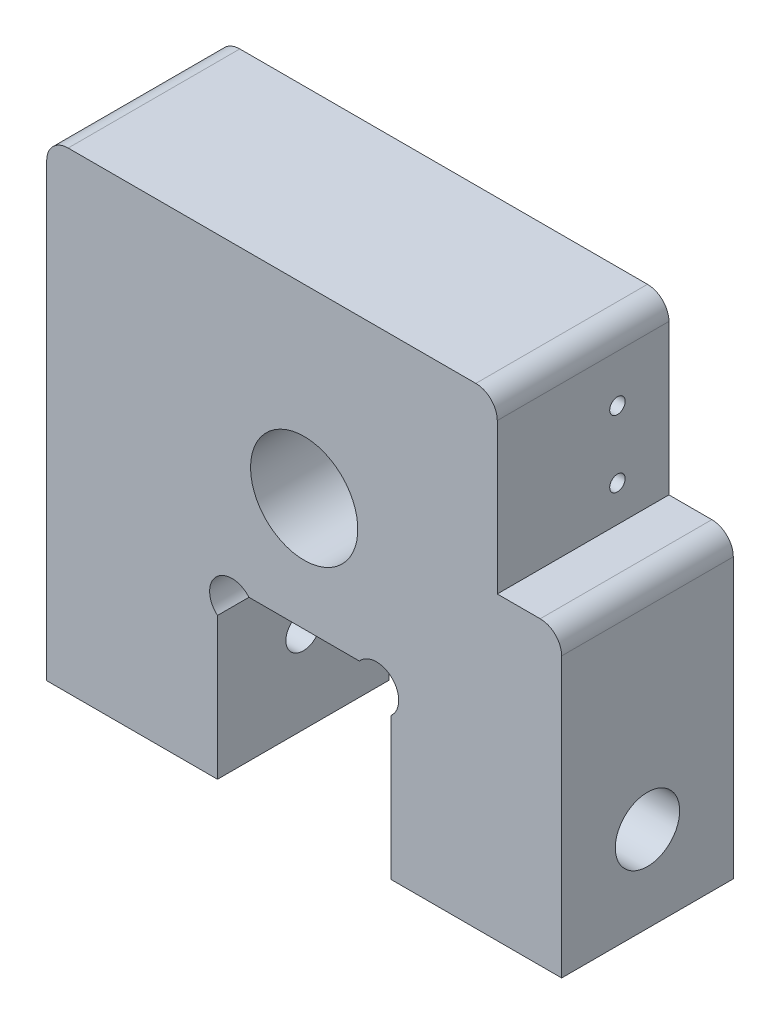
ISO-10303-21;
HEADER;
FILE_DESCRIPTION(('STEP AP214'),'2;1');
FILE_NAME('part.step','',(''),(''),'','','');
FILE_SCHEMA(('AUTOMOTIVE_DESIGN { 1 0 10303 214 1 1 1 1 }'));
ENDSEC;
DATA;
#1=APPLICATION_CONTEXT('core data for automotive mechanical design processes');
#2=APPLICATION_PROTOCOL_DEFINITION('international standard','automotive_design',2000,#1);
#3=PRODUCT_CONTEXT('',#1,'mechanical');
#4=PRODUCT('Part','Part','',(#3));
#5=PRODUCT_RELATED_PRODUCT_CATEGORY('part','',(#4));
#6=PRODUCT_DEFINITION_FORMATION('','',#4);
#7=PRODUCT_DEFINITION_CONTEXT('part definition',#1,'design');
#8=PRODUCT_DEFINITION('design','',#6,#7);
#9=PRODUCT_DEFINITION_SHAPE('','',#8);
#10=(LENGTH_UNIT() NAMED_UNIT(*) SI_UNIT(.MILLI.,.METRE.));
#11=(NAMED_UNIT(*) PLANE_ANGLE_UNIT() SI_UNIT($,.RADIAN.));
#12=(NAMED_UNIT(*) SI_UNIT($,.STERADIAN.) SOLID_ANGLE_UNIT());
#13=UNCERTAINTY_MEASURE_WITH_UNIT(LENGTH_MEASURE(1.E-05),#10,'distance_accuracy_value','');
#14=(GEOMETRIC_REPRESENTATION_CONTEXT(3) GLOBAL_UNCERTAINTY_ASSIGNED_CONTEXT((#13)) GLOBAL_UNIT_ASSIGNED_CONTEXT((#10,
#11,#12)) REPRESENTATION_CONTEXT('',''));
#15=CARTESIAN_POINT('',(0.,0.,0.));
#16=DIRECTION('',(0.,0.,1.));
#17=DIRECTION('',(1.,0.,0.));
#18=AXIS2_PLACEMENT_3D('',#15,#16,#17);
#19=CARTESIAN_POINT('',(-38.1,-22.225,12.7));
#20=DIRECTION('',(1.,0.,0.));
#21=DIRECTION('',(0.,0.,-1.));
#22=AXIS2_PLACEMENT_3D('',#19,#20,#21);
#23=CYLINDRICAL_SURFACE('',#22,2.5796875);
#24=CARTESIAN_POINT('',(-12.827,-22.225,12.7));
#25=DIRECTION('',(-1.,0.,0.));
#26=DIRECTION('',(0.,0.,1.));
#27=AXIS2_PLACEMENT_3D('',#24,#25,#26);
#28=CIRCLE('',#27,2.5796875);
#29=CARTESIAN_POINT('',(-12.827,-22.225,15.2796875));
#30=VERTEX_POINT('',#29);
#31=EDGE_CURVE('E248',#30,#30,#28,.T.);
#32=ORIENTED_EDGE('',*,*,#31,.F.);
#33=EDGE_LOOP('',(#32));
#34=FACE_BOUND('',#33,.T.);
#35=CARTESIAN_POINT('',(-27.7114,-22.225,12.7));
#36=DIRECTION('',(-1.,0.,0.));
#37=DIRECTION('',(0.,0.,1.));
#38=AXIS2_PLACEMENT_3D('',#35,#36,#37);
#39=CIRCLE('',#38,2.5796875);
#40=CARTESIAN_POINT('',(-27.7114,-22.225,15.2796875));
#41=VERTEX_POINT('',#40);
#42=EDGE_CURVE('E42',#41,#41,#39,.F.);
#43=ORIENTED_EDGE('',*,*,#42,.F.);
#44=EDGE_LOOP('',(#43));
#45=FACE_BOUND('',#44,.T.);
#46=ADVANCED_FACE('F38',(#34,#45),#23,.F.);
#47=CARTESIAN_POINT('',(12.827,-22.225,12.7));
#48=DIRECTION('',(1.,0.,0.));
#49=DIRECTION('',(0.,1.,0.));
#50=AXIS2_PLACEMENT_3D('',#47,#48,#49);
#51=CIRCLE('',#50,2.5796875);
#52=CARTESIAN_POINT('',(12.827,-19.6453125,12.7));
#53=VERTEX_POINT('',#52);
#54=EDGE_CURVE('E243',#53,#53,#51,.T.);
#55=ORIENTED_EDGE('',*,*,#54,.F.);
#56=EDGE_LOOP('',(#55));
#57=FACE_BOUND('',#56,.T.);
#58=CARTESIAN_POINT('',(27.7114,-22.225,12.7));
#59=DIRECTION('',(1.,0.,0.));
#60=DIRECTION('',(0.,0.,-1.));
#61=AXIS2_PLACEMENT_3D('',#58,#59,#60);
#62=CIRCLE('',#61,2.5796875);
#63=CARTESIAN_POINT('',(27.7114,-22.225,10.1203125));
#64=VERTEX_POINT('',#63);
#65=EDGE_CURVE('E215',#64,#64,#62,.F.);
#66=ORIENTED_EDGE('',*,*,#65,.F.);
#67=EDGE_LOOP('',(#66));
#68=FACE_BOUND('',#67,.T.);
#69=ADVANCED_FACE('F385',(#57,#68),#23,.F.);
#70=CARTESIAN_POINT('',(10.688214242642,-11.409785757358,25.4));
#71=DIRECTION('',(0.,0.,-1.));
#72=DIRECTION('',(-1.,0.,0.));
#73=AXIS2_PLACEMENT_3D('',#70,#71,#72);
#74=PLANE('',#73);
#75=CARTESIAN_POINT('',(0.,7.493,25.4));
#76=DIRECTION('',(0.,0.,-1.));
#77=DIRECTION('',(-1.,0.,0.));
#78=AXIS2_PLACEMENT_3D('',#75,#76,#77);
#79=CIRCLE('',#78,7.9375);
#80=CARTESIAN_POINT('',(-7.93750000000002,7.493,25.4));
#81=VERTEX_POINT('',#80);
#82=EDGE_CURVE('E253',#81,#81,#79,.T.);
#83=ORIENTED_EDGE('',*,*,#82,.T.);
#84=EDGE_LOOP('',(#83));
#85=FACE_BOUND('',#84,.T.);
#86=DIRECTION('',(-1.,0.,0.));
#87=VECTOR('',#86,1.);
#88=CARTESIAN_POINT('',(28.575,34.925,25.4));
#89=LINE('',#88,#87);
#90=CARTESIAN_POINT('',(25.4,34.925,25.4));
#91=VERTEX_POINT('',#90);
#92=CARTESIAN_POINT('',(-34.925,34.925,25.4));
#93=VERTEX_POINT('',#92);
#94=EDGE_CURVE('E286',#91,#93,#89,.T.);
#95=ORIENTED_EDGE('',*,*,#94,.T.);
#96=CARTESIAN_POINT('',(-34.925,31.75,25.4));
#97=DIRECTION('',(0.,0.,-1.));
#98=DIRECTION('',(-1.,0.,0.));
#99=AXIS2_PLACEMENT_3D('',#96,#97,#98);
#100=CIRCLE('',#99,3.175);
#101=CARTESIAN_POINT('',(-38.1,31.75,25.4));
#102=VERTEX_POINT('',#101);
#103=EDGE_CURVE('E154',#93,#102,#100,.F.);
#104=ORIENTED_EDGE('',*,*,#103,.T.);
#105=DIRECTION('',(0.,-1.,0.));
#106=VECTOR('',#105,1.);
#107=CARTESIAN_POINT('',(-38.1,-34.925,25.4));
#108=LINE('',#107,#106);
#109=CARTESIAN_POINT('',(-38.1,-34.925,25.4));
#110=VERTEX_POINT('',#109);
#111=EDGE_CURVE('E147',#102,#110,#108,.T.);
#112=ORIENTED_EDGE('',*,*,#111,.T.);
#113=DIRECTION('',(1.,0.,0.));
#114=VECTOR('',#113,1.);
#115=CARTESIAN_POINT('',(-12.827,-34.925,25.4));
#116=LINE('',#115,#114);
#117=CARTESIAN_POINT('',(-12.827,-34.925,25.4));
#118=VERTEX_POINT('',#117);
#119=EDGE_CURVE('E151',#110,#118,#116,.T.);
#120=ORIENTED_EDGE('',*,*,#119,.T.);
#121=DIRECTION('',(0.,1.,0.));
#122=VECTOR('',#121,1.);
#123=CARTESIAN_POINT('',(-12.827,-34.925,25.4));
#124=LINE('',#123,#122);
#125=CARTESIAN_POINT('',(-12.827,-13.9254962900152,25.4));
#126=VERTEX_POINT('',#125);
#127=EDGE_CURVE('E170',#118,#126,#124,.T.);
#128=ORIENTED_EDGE('',*,*,#127,.T.);
#129=CARTESIAN_POINT('',(-10.688214242642,-11.409785757358,25.4));
#130=DIRECTION('',(0.,0.,-1.));
#131=DIRECTION('',(1.,0.,0.));
#132=AXIS2_PLACEMENT_3D('',#129,#130,#131);
#133=CIRCLE('',#132,3.302);
#134=CARTESIAN_POINT('',(-8.17250370998475,-9.271,25.4));
#135=VERTEX_POINT('',#134);
#136=EDGE_CURVE('E262',#126,#135,#133,.T.);
#137=ORIENTED_EDGE('',*,*,#136,.T.);
#138=DIRECTION('',(1.,0.,0.));
#139=VECTOR('',#138,1.);
#140=CARTESIAN_POINT('',(8.17250370998477,-9.271,25.4));
#141=LINE('',#140,#139);
#142=CARTESIAN_POINT('',(8.17250370998477,-9.271,25.4));
#143=VERTEX_POINT('',#142);
#144=EDGE_CURVE('E265',#135,#143,#141,.T.);
#145=ORIENTED_EDGE('',*,*,#144,.T.);
#146=CARTESIAN_POINT('',(10.688214242642,-11.409785757358,25.4));
#147=DIRECTION('',(0.,0.,-1.));
#148=DIRECTION('',(-1.,0.,0.));
#149=AXIS2_PLACEMENT_3D('',#146,#147,#148);
#150=CIRCLE('',#149,3.302);
#151=CARTESIAN_POINT('',(12.827,-13.9254962900152,25.4));
#152=VERTEX_POINT('',#151);
#153=EDGE_CURVE('E268',#143,#152,#150,.T.);
#154=ORIENTED_EDGE('',*,*,#153,.T.);
#155=DIRECTION('',(0.,-1.,0.));
#156=VECTOR('',#155,1.);
#157=CARTESIAN_POINT('',(12.827,-34.925,25.4));
#158=LINE('',#157,#156);
#159=CARTESIAN_POINT('',(12.827,-34.925,25.4));
#160=VERTEX_POINT('',#159);
#161=EDGE_CURVE('E271',#152,#160,#158,.T.);
#162=ORIENTED_EDGE('',*,*,#161,.T.);
#163=DIRECTION('',(1.,0.,0.));
#164=VECTOR('',#163,1.);
#165=CARTESIAN_POINT('',(38.1,-34.925,25.4));
#166=LINE('',#165,#164);
#167=CARTESIAN_POINT('',(38.1,-34.925,25.4));
#168=VERTEX_POINT('',#167);
#169=EDGE_CURVE('E274',#160,#168,#166,.T.);
#170=ORIENTED_EDGE('',*,*,#169,.T.);
#171=DIRECTION('',(0.,1.,0.));
#172=VECTOR('',#171,1.);
#173=CARTESIAN_POINT('',(38.1,-34.925,25.4));
#174=LINE('',#173,#172);
#175=CARTESIAN_POINT('',(38.1,6.35,25.4));
#176=VERTEX_POINT('',#175);
#177=EDGE_CURVE('E277',#168,#176,#174,.T.);
#178=ORIENTED_EDGE('',*,*,#177,.T.);
#179=CARTESIAN_POINT('',(34.925,6.35,25.4));
#180=DIRECTION('',(0.,0.,-1.));
#181=DIRECTION('',(-1.,0.,0.));
#182=AXIS2_PLACEMENT_3D('',#179,#180,#181);
#183=CIRCLE('',#182,3.175);
#184=CARTESIAN_POINT('',(34.925,9.525,25.4));
#185=VERTEX_POINT('',#184);
#186=EDGE_CURVE('E62',#176,#185,#183,.F.);
#187=ORIENTED_EDGE('',*,*,#186,.T.);
#188=DIRECTION('',(-1.,0.,0.));
#189=VECTOR('',#188,1.);
#190=CARTESIAN_POINT('',(28.575,9.525,25.4));
#191=LINE('',#190,#189);
#192=CARTESIAN_POINT('',(28.575,9.525,25.4));
#193=VERTEX_POINT('',#192);
#194=EDGE_CURVE('E280',#185,#193,#191,.T.);
#195=ORIENTED_EDGE('',*,*,#194,.T.);
#196=DIRECTION('',(0.,1.,0.));
#197=VECTOR('',#196,1.);
#198=CARTESIAN_POINT('',(28.575,9.525,25.4));
#199=LINE('',#198,#197);
#200=CARTESIAN_POINT('',(28.575,31.75,25.4));
#201=VERTEX_POINT('',#200);
#202=EDGE_CURVE('E283',#193,#201,#199,.T.);
#203=ORIENTED_EDGE('',*,*,#202,.T.);
#204=CARTESIAN_POINT('',(25.4,31.75,25.4));
#205=DIRECTION('',(0.,0.,-1.));
#206=DIRECTION('',(-1.,0.,0.));
#207=AXIS2_PLACEMENT_3D('',#204,#205,#206);
#208=CIRCLE('',#207,3.175);
#209=EDGE_CURVE('E203',#201,#91,#208,.F.);
#210=ORIENTED_EDGE('',*,*,#209,.T.);
#211=EDGE_LOOP('',(#95,#104,#112,#120,#128,#137,#145,#154,#162,#170,#178,#187,#195,#203,#210));
#212=FACE_BOUND('',#211,.T.);
#213=ADVANCED_FACE('F150',(#85,#212),#74,.F.);
#214=CARTESIAN_POINT('',(10.688214242642,-11.409785757358,0.));
#215=DIRECTION('',(0.,0.,-1.));
#216=DIRECTION('',(-1.,0.,0.));
#217=AXIS2_PLACEMENT_3D('',#214,#215,#216);
#218=PLANE('',#217);
#219=CARTESIAN_POINT('',(0.,7.493,0.));
#220=DIRECTION('',(0.,0.,-1.));
#221=DIRECTION('',(-1.,0.,0.));
#222=AXIS2_PLACEMENT_3D('',#219,#220,#221);
#223=CIRCLE('',#222,7.9375);
#224=CARTESIAN_POINT('',(-7.93750000000002,7.493,0.));
#225=VERTEX_POINT('',#224);
#226=EDGE_CURVE('E252',#225,#225,#223,.T.);
#227=ORIENTED_EDGE('',*,*,#226,.F.);
#228=EDGE_LOOP('',(#227));
#229=FACE_BOUND('',#228,.T.);
#230=DIRECTION('',(0.,-1.,0.));
#231=VECTOR('',#230,1.);
#232=CARTESIAN_POINT('',(-38.1,-34.925,0.));
#233=LINE('',#232,#231);
#234=CARTESIAN_POINT('',(-38.1,31.75,0.));
#235=VERTEX_POINT('',#234);
#236=CARTESIAN_POINT('',(-38.1,-34.925,0.));
#237=VERTEX_POINT('',#236);
#238=EDGE_CURVE('E174',#235,#237,#233,.T.);
#239=ORIENTED_EDGE('',*,*,#238,.F.);
#240=CARTESIAN_POINT('',(-34.925,31.75,0.));
#241=DIRECTION('',(0.,0.,-1.));
#242=DIRECTION('',(-1.,0.,0.));
#243=AXIS2_PLACEMENT_3D('',#240,#241,#242);
#244=CIRCLE('',#243,3.175);
#245=CARTESIAN_POINT('',(-34.925,34.925,0.));
#246=VERTEX_POINT('',#245);
#247=EDGE_CURVE('E193',#235,#246,#244,.T.);
#248=ORIENTED_EDGE('',*,*,#247,.T.);
#249=DIRECTION('',(-1.,0.,0.));
#250=VECTOR('',#249,1.);
#251=CARTESIAN_POINT('',(28.575,34.925,0.));
#252=LINE('',#251,#250);
#253=CARTESIAN_POINT('',(25.4,34.925,0.));
#254=VERTEX_POINT('',#253);
#255=EDGE_CURVE('E160',#254,#246,#252,.T.);
#256=ORIENTED_EDGE('',*,*,#255,.F.);
#257=CARTESIAN_POINT('',(25.4,31.75,0.));
#258=DIRECTION('',(0.,0.,-1.));
#259=DIRECTION('',(-1.,0.,0.));
#260=AXIS2_PLACEMENT_3D('',#257,#258,#259);
#261=CIRCLE('',#260,3.175);
#262=CARTESIAN_POINT('',(28.575,31.75,0.));
#263=VERTEX_POINT('',#262);
#264=EDGE_CURVE('E182',#254,#263,#261,.T.);
#265=ORIENTED_EDGE('',*,*,#264,.T.);
#266=DIRECTION('',(0.,1.,0.));
#267=VECTOR('',#266,1.);
#268=CARTESIAN_POINT('',(28.575,30.099,0.));
#269=LINE('',#268,#267);
#270=CARTESIAN_POINT('',(28.575,9.525,0.));
#271=VERTEX_POINT('',#270);
#272=EDGE_CURVE('E320',#271,#263,#269,.T.);
#273=ORIENTED_EDGE('',*,*,#272,.F.);
#274=DIRECTION('',(-1.,0.,0.));
#275=VECTOR('',#274,1.);
#276=CARTESIAN_POINT('',(28.575,9.525,0.));
#277=LINE('',#276,#275);
#278=CARTESIAN_POINT('',(34.925,9.525,0.));
#279=VERTEX_POINT('',#278);
#280=EDGE_CURVE('E317',#279,#271,#277,.T.);
#281=ORIENTED_EDGE('',*,*,#280,.F.);
#282=CARTESIAN_POINT('',(34.925,6.35,0.));
#283=DIRECTION('',(0.,0.,-1.));
#284=DIRECTION('',(-1.,0.,0.));
#285=AXIS2_PLACEMENT_3D('',#282,#283,#284);
#286=CIRCLE('',#285,3.175);
#287=CARTESIAN_POINT('',(38.1,6.35,0.));
#288=VERTEX_POINT('',#287);
#289=EDGE_CURVE('E190',#279,#288,#286,.T.);
#290=ORIENTED_EDGE('',*,*,#289,.T.);
#291=DIRECTION('',(0.,1.,0.));
#292=VECTOR('',#291,1.);
#293=CARTESIAN_POINT('',(38.1,-34.925,0.));
#294=LINE('',#293,#292);
#295=CARTESIAN_POINT('',(38.1,-34.925,0.));
#296=VERTEX_POINT('',#295);
#297=EDGE_CURVE('E313',#296,#288,#294,.T.);
#298=ORIENTED_EDGE('',*,*,#297,.F.);
#299=DIRECTION('',(1.,0.,0.));
#300=VECTOR('',#299,1.);
#301=CARTESIAN_POINT('',(38.1,-34.925,0.));
#302=LINE('',#301,#300);
#303=CARTESIAN_POINT('',(12.827,-34.925,0.));
#304=VERTEX_POINT('',#303);
#305=EDGE_CURVE('E310',#304,#296,#302,.T.);
#306=ORIENTED_EDGE('',*,*,#305,.F.);
#307=DIRECTION('',(0.,-1.,0.));
#308=VECTOR('',#307,1.);
#309=CARTESIAN_POINT('',(12.827,-34.925,0.));
#310=LINE('',#309,#308);
#311=CARTESIAN_POINT('',(12.827,-13.9254962900152,0.));
#312=VERTEX_POINT('',#311);
#313=EDGE_CURVE('E307',#312,#304,#310,.T.);
#314=ORIENTED_EDGE('',*,*,#313,.F.);
#315=CARTESIAN_POINT('',(10.688214242642,-11.409785757358,0.));
#316=DIRECTION('',(0.,0.,-1.));
#317=DIRECTION('',(-1.,0.,0.));
#318=AXIS2_PLACEMENT_3D('',#315,#316,#317);
#319=CIRCLE('',#318,3.302);
#320=CARTESIAN_POINT('',(8.17250370998477,-9.271,0.));
#321=VERTEX_POINT('',#320);
#322=EDGE_CURVE('E304',#321,#312,#319,.T.);
#323=ORIENTED_EDGE('',*,*,#322,.F.);
#324=DIRECTION('',(1.,0.,0.));
#325=VECTOR('',#324,1.);
#326=CARTESIAN_POINT('',(8.17250370998477,-9.271,0.));
#327=LINE('',#326,#325);
#328=CARTESIAN_POINT('',(-8.17250370998475,-9.271,0.));
#329=VERTEX_POINT('',#328);
#330=EDGE_CURVE('E301',#329,#321,#327,.T.);
#331=ORIENTED_EDGE('',*,*,#330,.F.);
#332=CARTESIAN_POINT('',(-10.688214242642,-11.409785757358,0.));
#333=DIRECTION('',(0.,0.,-1.));
#334=DIRECTION('',(1.,0.,0.));
#335=AXIS2_PLACEMENT_3D('',#332,#333,#334);
#336=CIRCLE('',#335,3.302);
#337=CARTESIAN_POINT('',(-12.827,-13.9254962900152,0.));
#338=VERTEX_POINT('',#337);
#339=EDGE_CURVE('E298',#338,#329,#336,.T.);
#340=ORIENTED_EDGE('',*,*,#339,.F.);
#341=DIRECTION('',(0.,1.,0.));
#342=VECTOR('',#341,1.);
#343=CARTESIAN_POINT('',(-12.827,-34.925,0.));
#344=LINE('',#343,#342);
#345=CARTESIAN_POINT('',(-12.827,-34.925,0.));
#346=VERTEX_POINT('',#345);
#347=EDGE_CURVE('E295',#346,#338,#344,.T.);
#348=ORIENTED_EDGE('',*,*,#347,.F.);
#349=DIRECTION('',(1.,0.,0.));
#350=VECTOR('',#349,1.);
#351=CARTESIAN_POINT('',(-12.827,-34.925,0.));
#352=LINE('',#351,#350);
#353=EDGE_CURVE('E292',#237,#346,#352,.T.);
#354=ORIENTED_EDGE('',*,*,#353,.F.);
#355=EDGE_LOOP('',(#239,#248,#256,#265,#273,#281,#290,#298,#306,#314,#323,#331,#340,#348,#354));
#356=FACE_BOUND('',#355,.T.);
#357=ADVANCED_FACE('F361',(#229,#356),#218,.T.);
#358=CARTESIAN_POINT('',(-38.1,-34.925,25.4));
#359=DIRECTION('',(1.,0.,0.));
#360=DIRECTION('',(0.,0.,-1.));
#361=AXIS2_PLACEMENT_3D('',#358,#359,#360);
#362=PLANE('',#361);
#363=CARTESIAN_POINT('',(-38.1,-22.225,12.7));
#364=DIRECTION('',(1.,0.,0.));
#365=DIRECTION('',(0.,0.,-1.));
#366=AXIS2_PLACEMENT_3D('',#363,#364,#365);
#367=CIRCLE('',#366,4.7625);
#368=CARTESIAN_POINT('',(-38.1,-22.225,7.9375));
#369=VERTEX_POINT('',#368);
#370=EDGE_CURVE('E238',#369,#369,#367,.T.);
#371=ORIENTED_EDGE('',*,*,#370,.T.);
#372=EDGE_LOOP('',(#371));
#373=FACE_BOUND('',#372,.T.);
#374=CARTESIAN_POINT('',(-38.1,28.575,12.7));
#375=DIRECTION('',(-1.,0.,0.));
#376=DIRECTION('',(0.,0.,1.));
#377=AXIS2_PLACEMENT_3D('',#374,#375,#376);
#378=CIRCLE('',#377,1.35255);
#379=CARTESIAN_POINT('',(-38.1,28.575,14.05255));
#380=VERTEX_POINT('',#379);
#381=EDGE_CURVE('E218',#380,#380,#378,.T.);
#382=ORIENTED_EDGE('',*,*,#381,.F.);
#383=EDGE_LOOP('',(#382));
#384=FACE_BOUND('',#383,.T.);
#385=ORIENTED_EDGE('',*,*,#111,.F.);
#386=DIRECTION('',(0.,0.,-1.));
#387=VECTOR('',#386,1.);
#388=CARTESIAN_POINT('',(-38.1,31.75,25.4));
#389=LINE('',#388,#387);
#390=EDGE_CURVE('E177',#102,#235,#389,.T.);
#391=ORIENTED_EDGE('',*,*,#390,.T.);
#392=ORIENTED_EDGE('',*,*,#238,.T.);
#393=DIRECTION('',(0.,0.,-1.));
#394=VECTOR('',#393,1.);
#395=CARTESIAN_POINT('',(-38.1,-34.925,25.4));
#396=LINE('',#395,#394);
#397=EDGE_CURVE('E165',#110,#237,#396,.T.);
#398=ORIENTED_EDGE('',*,*,#397,.F.);
#399=EDGE_LOOP('',(#385,#391,#392,#398));
#400=FACE_BOUND('',#399,.T.);
#401=ADVANCED_FACE('F172',(#373,#384,#400),#362,.F.);
#402=CARTESIAN_POINT('',(-12.827,-34.925,25.4));
#403=DIRECTION('',(0.,1.,0.));
#404=DIRECTION('',(-1.,0.,0.));
#405=AXIS2_PLACEMENT_3D('',#402,#403,#404);
#406=PLANE('',#405);
#407=ORIENTED_EDGE('',*,*,#353,.T.);
#408=DIRECTION('',(0.,0.,-1.));
#409=VECTOR('',#408,1.);
#410=CARTESIAN_POINT('',(-12.827,-34.925,25.4));
#411=LINE('',#410,#409);
#412=EDGE_CURVE('E167',#118,#346,#411,.T.);
#413=ORIENTED_EDGE('',*,*,#412,.F.);
#414=ORIENTED_EDGE('',*,*,#119,.F.);
#415=ORIENTED_EDGE('',*,*,#397,.T.);
#416=EDGE_LOOP('',(#407,#413,#414,#415));
#417=FACE_BOUND('',#416,.T.);
#418=ADVANCED_FACE('F164',(#417),#406,.F.);
#419=CARTESIAN_POINT('',(-12.827,-34.925,25.4));
#420=DIRECTION('',(-1.,0.,0.));
#421=DIRECTION('',(0.,0.,1.));
#422=AXIS2_PLACEMENT_3D('',#419,#420,#421);
#423=PLANE('',#422);
#424=ORIENTED_EDGE('',*,*,#31,.T.);
#425=EDGE_LOOP('',(#424));
#426=FACE_BOUND('',#425,.T.);
#427=ORIENTED_EDGE('',*,*,#347,.T.);
#428=DIRECTION('',(0.,0.,-1.));
#429=VECTOR('',#428,1.);
#430=CARTESIAN_POINT('',(-12.827,-13.9254962900152,25.4));
#431=LINE('',#430,#429);
#432=EDGE_CURVE('E184',#126,#338,#431,.T.);
#433=ORIENTED_EDGE('',*,*,#432,.F.);
#434=ORIENTED_EDGE('',*,*,#127,.F.);
#435=ORIENTED_EDGE('',*,*,#412,.T.);
#436=EDGE_LOOP('',(#427,#433,#434,#435));
#437=FACE_BOUND('',#436,.T.);
#438=ADVANCED_FACE('F374',(#426,#437),#423,.F.);
#439=CARTESIAN_POINT('',(-10.688214242642,-11.409785757358,25.4));
#440=DIRECTION('',(0.,0.,-1.));
#441=DIRECTION('',(-1.,0.,0.));
#442=AXIS2_PLACEMENT_3D('',#439,#440,#441);
#443=CYLINDRICAL_SURFACE('',#442,3.302);
#444=ORIENTED_EDGE('',*,*,#339,.T.);
#445=DIRECTION('',(0.,0.,-1.));
#446=VECTOR('',#445,1.);
#447=CARTESIAN_POINT('',(-8.17250370998475,-9.271,25.4));
#448=LINE('',#447,#446);
#449=EDGE_CURVE('E345',#135,#329,#448,.T.);
#450=ORIENTED_EDGE('',*,*,#449,.F.);
#451=ORIENTED_EDGE('',*,*,#136,.F.);
#452=ORIENTED_EDGE('',*,*,#432,.T.);
#453=EDGE_LOOP('',(#444,#450,#451,#452));
#454=FACE_BOUND('',#453,.T.);
#455=ADVANCED_FACE('F355',(#454),#443,.F.);
#456=CARTESIAN_POINT('',(8.17250370998477,-9.271,25.4));
#457=DIRECTION('',(0.,1.,0.));
#458=DIRECTION('',(0.,0.,1.));
#459=AXIS2_PLACEMENT_3D('',#456,#457,#458);
#460=PLANE('',#459);
#461=ORIENTED_EDGE('',*,*,#330,.T.);
#462=DIRECTION('',(0.,0.,-1.));
#463=VECTOR('',#462,1.);
#464=CARTESIAN_POINT('',(8.17250370998477,-9.271,25.4));
#465=LINE('',#464,#463);
#466=EDGE_CURVE('E341',#143,#321,#465,.T.);
#467=ORIENTED_EDGE('',*,*,#466,.F.);
#468=ORIENTED_EDGE('',*,*,#144,.F.);
#469=ORIENTED_EDGE('',*,*,#449,.T.);
#470=EDGE_LOOP('',(#461,#467,#468,#469));
#471=FACE_BOUND('',#470,.T.);
#472=ADVANCED_FACE('F366',(#471),#460,.F.);
#473=CARTESIAN_POINT('',(10.688214242642,-11.409785757358,25.4));
#474=DIRECTION('',(0.,0.,-1.));
#475=DIRECTION('',(-1.,0.,0.));
#476=AXIS2_PLACEMENT_3D('',#473,#474,#475);
#477=CYLINDRICAL_SURFACE('',#476,3.302);
#478=ORIENTED_EDGE('',*,*,#322,.T.);
#479=DIRECTION('',(0.,0.,-1.));
#480=VECTOR('',#479,1.);
#481=CARTESIAN_POINT('',(12.827,-13.9254962900152,25.4));
#482=LINE('',#481,#480);
#483=EDGE_CURVE('E337',#152,#312,#482,.T.);
#484=ORIENTED_EDGE('',*,*,#483,.F.);
#485=ORIENTED_EDGE('',*,*,#153,.F.);
#486=ORIENTED_EDGE('',*,*,#466,.T.);
#487=EDGE_LOOP('',(#478,#484,#485,#486));
#488=FACE_BOUND('',#487,.T.);
#489=ADVANCED_FACE('F370',(#488),#477,.F.);
#490=CARTESIAN_POINT('',(12.827,-34.925,25.4));
#491=DIRECTION('',(1.,0.,0.));
#492=DIRECTION('',(0.,1.,0.));
#493=AXIS2_PLACEMENT_3D('',#490,#491,#492);
#494=PLANE('',#493);
#495=ORIENTED_EDGE('',*,*,#54,.T.);
#496=EDGE_LOOP('',(#495));
#497=FACE_BOUND('',#496,.T.);
#498=ORIENTED_EDGE('',*,*,#313,.T.);
#499=DIRECTION('',(0.,0.,-1.));
#500=VECTOR('',#499,1.);
#501=CARTESIAN_POINT('',(12.827,-34.925,25.4));
#502=LINE('',#501,#500);
#503=EDGE_CURVE('E333',#160,#304,#502,.T.);
#504=ORIENTED_EDGE('',*,*,#503,.F.);
#505=ORIENTED_EDGE('',*,*,#161,.F.);
#506=ORIENTED_EDGE('',*,*,#483,.T.);
#507=EDGE_LOOP('',(#498,#504,#505,#506));
#508=FACE_BOUND('',#507,.T.);
#509=ADVANCED_FACE('F428',(#497,#508),#494,.F.);
#510=CARTESIAN_POINT('',(38.1,-34.925,25.4));
#511=DIRECTION('',(0.,1.,0.));
#512=DIRECTION('',(0.,0.,1.));
#513=AXIS2_PLACEMENT_3D('',#510,#511,#512);
#514=PLANE('',#513);
#515=ORIENTED_EDGE('',*,*,#305,.T.);
#516=DIRECTION('',(0.,0.,-1.));
#517=VECTOR('',#516,1.);
#518=CARTESIAN_POINT('',(38.1,-34.925,25.4));
#519=LINE('',#518,#517);
#520=EDGE_CURVE('E329',#168,#296,#519,.T.);
#521=ORIENTED_EDGE('',*,*,#520,.F.);
#522=ORIENTED_EDGE('',*,*,#169,.F.);
#523=ORIENTED_EDGE('',*,*,#503,.T.);
#524=EDGE_LOOP('',(#515,#521,#522,#523));
#525=FACE_BOUND('',#524,.T.);
#526=ADVANCED_FACE('F424',(#525),#514,.F.);
#527=CARTESIAN_POINT('',(38.1,-34.925,25.4));
#528=DIRECTION('',(-1.,0.,0.));
#529=DIRECTION('',(0.,0.,1.));
#530=AXIS2_PLACEMENT_3D('',#527,#528,#529);
#531=PLANE('',#530);
#532=CARTESIAN_POINT('',(38.1,-22.225,12.7));
#533=DIRECTION('',(1.,0.,0.));
#534=DIRECTION('',(0.,0.,-1.));
#535=AXIS2_PLACEMENT_3D('',#532,#533,#534);
#536=CIRCLE('',#535,4.7625);
#537=CARTESIAN_POINT('',(38.1,-22.225,7.9375));
#538=VERTEX_POINT('',#537);
#539=EDGE_CURVE('E229',#538,#538,#536,.T.);
#540=ORIENTED_EDGE('',*,*,#539,.F.);
#541=EDGE_LOOP('',(#540));
#542=FACE_BOUND('',#541,.T.);
#543=ORIENTED_EDGE('',*,*,#297,.T.);
#544=DIRECTION('',(0.,0.,-1.));
#545=VECTOR('',#544,1.);
#546=CARTESIAN_POINT('',(38.1,6.35,25.4));
#547=LINE('',#546,#545);
#548=EDGE_CURVE('E48',#288,#176,#547,.F.);
#549=ORIENTED_EDGE('',*,*,#548,.T.);
#550=ORIENTED_EDGE('',*,*,#177,.F.);
#551=ORIENTED_EDGE('',*,*,#520,.T.);
#552=EDGE_LOOP('',(#543,#549,#550,#551));
#553=FACE_BOUND('',#552,.T.);
#554=ADVANCED_FACE('F420',(#542,#553),#531,.F.);
#555=CARTESIAN_POINT('',(28.575,9.525,25.4));
#556=DIRECTION('',(0.,-1.,0.));
#557=DIRECTION('',(0.,0.,-1.));
#558=AXIS2_PLACEMENT_3D('',#555,#556,#557);
#559=PLANE('',#558);
#560=ORIENTED_EDGE('',*,*,#194,.F.);
#561=DIRECTION('',(0.,0.,-1.));
#562=VECTOR('',#561,1.);
#563=CARTESIAN_POINT('',(34.925,9.525,25.4));
#564=LINE('',#563,#562);
#565=EDGE_CURVE('E210',#185,#279,#564,.T.);
#566=ORIENTED_EDGE('',*,*,#565,.T.);
#567=ORIENTED_EDGE('',*,*,#280,.T.);
#568=DIRECTION('',(0.,0.,-1.));
#569=VECTOR('',#568,1.);
#570=CARTESIAN_POINT('',(28.575,9.525,25.4));
#571=LINE('',#570,#569);
#572=EDGE_CURVE('E289',#193,#271,#571,.T.);
#573=ORIENTED_EDGE('',*,*,#572,.F.);
#574=EDGE_LOOP('',(#560,#566,#567,#573));
#575=FACE_BOUND('',#574,.T.);
#576=ADVANCED_FACE('F416',(#575),#559,.F.);
#577=CARTESIAN_POINT('',(28.575,30.099,25.4));
#578=DIRECTION('',(-1.,0.,0.));
#579=DIRECTION('',(0.,0.,1.));
#580=AXIS2_PLACEMENT_3D('',#577,#578,#579);
#581=PLANE('',#580);
#582=CARTESIAN_POINT('',(28.575,14.859,7.62));
#583=DIRECTION('',(1.,0.,0.));
#584=DIRECTION('',(0.,0.,-1.));
#585=AXIS2_PLACEMENT_3D('',#582,#583,#584);
#586=CIRCLE('',#585,1.143);
#587=CARTESIAN_POINT('',(28.575,14.859,6.477));
#588=VERTEX_POINT('',#587);
#589=EDGE_CURVE('E736',#588,#588,#586,.T.);
#590=ORIENTED_EDGE('',*,*,#589,.F.);
#591=EDGE_LOOP('',(#590));
#592=FACE_BOUND('',#591,.T.);
#593=CARTESIAN_POINT('',(28.575,24.765,7.62));
#594=DIRECTION('',(1.,0.,0.));
#595=DIRECTION('',(0.,0.,-1.));
#596=AXIS2_PLACEMENT_3D('',#593,#594,#595);
#597=CIRCLE('',#596,1.143);
#598=CARTESIAN_POINT('',(28.575,24.765,6.477));
#599=VERTEX_POINT('',#598);
#600=EDGE_CURVE('E748',#599,#599,#597,.T.);
#601=ORIENTED_EDGE('',*,*,#600,.F.);
#602=EDGE_LOOP('',(#601));
#603=FACE_BOUND('',#602,.T.);
#604=ORIENTED_EDGE('',*,*,#272,.T.);
#605=DIRECTION('',(0.,0.,-1.));
#606=VECTOR('',#605,1.);
#607=CARTESIAN_POINT('',(28.575,31.75,25.4));
#608=LINE('',#607,#606);
#609=EDGE_CURVE('E11',#263,#201,#608,.F.);
#610=ORIENTED_EDGE('',*,*,#609,.T.);
#611=ORIENTED_EDGE('',*,*,#202,.F.);
#612=ORIENTED_EDGE('',*,*,#572,.T.);
#613=EDGE_LOOP('',(#604,#610,#611,#612));
#614=FACE_BOUND('',#613,.T.);
#615=ADVANCED_FACE('F412',(#592,#603,#614),#581,.F.);
#616=CARTESIAN_POINT('',(28.575,34.925,25.4));
#617=DIRECTION('',(0.,-1.,0.));
#618=DIRECTION('',(1.,0.,0.));
#619=AXIS2_PLACEMENT_3D('',#616,#617,#618);
#620=PLANE('',#619);
#621=ORIENTED_EDGE('',*,*,#255,.T.);
#622=DIRECTION('',(0.,0.,-1.));
#623=VECTOR('',#622,1.);
#624=CARTESIAN_POINT('',(-34.925,34.925,25.4));
#625=LINE('',#624,#623);
#626=EDGE_CURVE('E200',#246,#93,#625,.F.);
#627=ORIENTED_EDGE('',*,*,#626,.T.);
#628=ORIENTED_EDGE('',*,*,#94,.F.);
#629=DIRECTION('',(0.,0.,-1.));
#630=VECTOR('',#629,1.);
#631=CARTESIAN_POINT('',(25.4,34.925,25.4));
#632=LINE('',#631,#630);
#633=EDGE_CURVE('E196',#91,#254,#632,.T.);
#634=ORIENTED_EDGE('',*,*,#633,.T.);
#635=EDGE_LOOP('',(#621,#627,#628,#634));
#636=FACE_BOUND('',#635,.T.);
#637=ADVANCED_FACE('F402',(#636),#620,.F.);
#638=CARTESIAN_POINT('',(0.,7.493,25.4));
#639=DIRECTION('',(0.,0.,-1.));
#640=DIRECTION('',(-1.,0.,0.));
#641=AXIS2_PLACEMENT_3D('',#638,#639,#640);
#642=CYLINDRICAL_SURFACE('',#641,7.9375);
#643=ORIENTED_EDGE('',*,*,#82,.F.);
#644=EDGE_LOOP('',(#643));
#645=FACE_BOUND('',#644,.T.);
#646=ORIENTED_EDGE('',*,*,#226,.T.);
#647=EDGE_LOOP('',(#646));
#648=FACE_BOUND('',#647,.T.);
#649=ADVANCED_FACE('F398',(#645,#648),#642,.F.);
#650=CARTESIAN_POINT('',(-34.925,31.75,25.4));
#651=DIRECTION('',(0.,0.,-1.));
#652=DIRECTION('',(-1.,0.,0.));
#653=AXIS2_PLACEMENT_3D('',#650,#651,#652);
#654=CYLINDRICAL_SURFACE('',#653,3.175);
#655=ORIENTED_EDGE('',*,*,#103,.F.);
#656=ORIENTED_EDGE('',*,*,#626,.F.);
#657=ORIENTED_EDGE('',*,*,#247,.F.);
#658=ORIENTED_EDGE('',*,*,#390,.F.);
#659=EDGE_LOOP('',(#655,#656,#657,#658));
#660=FACE_BOUND('',#659,.T.);
#661=ADVANCED_FACE('F401',(#660),#654,.T.);
#662=CARTESIAN_POINT('',(34.925,6.35,25.4));
#663=DIRECTION('',(0.,0.,-1.));
#664=DIRECTION('',(-1.,0.,0.));
#665=AXIS2_PLACEMENT_3D('',#662,#663,#664);
#666=CYLINDRICAL_SURFACE('',#665,3.175);
#667=ORIENTED_EDGE('',*,*,#186,.F.);
#668=ORIENTED_EDGE('',*,*,#548,.F.);
#669=ORIENTED_EDGE('',*,*,#289,.F.);
#670=ORIENTED_EDGE('',*,*,#565,.F.);
#671=EDGE_LOOP('',(#667,#668,#669,#670));
#672=FACE_BOUND('',#671,.T.);
#673=ADVANCED_FACE('F478',(#672),#666,.T.);
#674=CARTESIAN_POINT('',(25.4,31.75,25.4));
#675=DIRECTION('',(0.,0.,-1.));
#676=DIRECTION('',(-1.,0.,0.));
#677=AXIS2_PLACEMENT_3D('',#674,#675,#676);
#678=CYLINDRICAL_SURFACE('',#677,3.175);
#679=ORIENTED_EDGE('',*,*,#209,.F.);
#680=ORIENTED_EDGE('',*,*,#609,.F.);
#681=ORIENTED_EDGE('',*,*,#264,.F.);
#682=ORIENTED_EDGE('',*,*,#633,.F.);
#683=EDGE_LOOP('',(#679,#680,#681,#682));
#684=FACE_BOUND('',#683,.T.);
#685=ADVANCED_FACE('F40',(#684),#678,.T.);
#686=CARTESIAN_POINT('',(-22.352,28.575,12.7));
#687=DIRECTION('',(-1.,0.,0.));
#688=DIRECTION('',(0.,0.,1.));
#689=AXIS2_PLACEMENT_3D('',#686,#687,#688);
#690=CYLINDRICAL_SURFACE('',#689,1.35255);
#691=CARTESIAN_POINT('',(-22.352,28.575,12.7));
#692=DIRECTION('',(-1.,0.,0.));
#693=DIRECTION('',(0.,0.,1.));
#694=AXIS2_PLACEMENT_3D('',#691,#692,#693);
#695=CIRCLE('',#694,1.35255);
#696=CARTESIAN_POINT('',(-22.352,28.575,14.05255));
#697=VERTEX_POINT('',#696);
#698=EDGE_CURVE('E226',#697,#697,#695,.T.);
#699=ORIENTED_EDGE('',*,*,#698,.F.);
#700=EDGE_LOOP('',(#699));
#701=FACE_BOUND('',#700,.T.);
#702=ORIENTED_EDGE('',*,*,#381,.T.);
#703=EDGE_LOOP('',(#702));
#704=FACE_BOUND('',#703,.T.);
#705=ADVANCED_FACE('F396',(#701,#704),#690,.F.);
#706=CARTESIAN_POINT('',(-22.352,28.575,12.7));
#707=DIRECTION('',(-1.,0.,0.));
#708=DIRECTION('',(0.,0.,1.));
#709=AXIS2_PLACEMENT_3D('',#706,#707,#708);
#710=PLANE('',#709);
#711=ORIENTED_EDGE('',*,*,#698,.T.);
#712=EDGE_LOOP('',(#711));
#713=FACE_BOUND('',#712,.T.);
#714=ADVANCED_FACE('F498',(#713),#710,.T.);
#715=CARTESIAN_POINT('',(27.7114,-22.225,12.7));
#716=DIRECTION('',(1.,0.,0.));
#717=DIRECTION('',(0.,0.,-1.));
#718=AXIS2_PLACEMENT_3D('',#715,#716,#717);
#719=PLANE('',#718);
#720=CARTESIAN_POINT('',(27.7114,-22.225,12.7));
#721=DIRECTION('',(1.,0.,0.));
#722=DIRECTION('',(0.,0.,-1.));
#723=AXIS2_PLACEMENT_3D('',#720,#721,#722);
#724=CIRCLE('',#723,4.7625);
#725=CARTESIAN_POINT('',(27.7114,-22.225,7.9375));
#726=VERTEX_POINT('',#725);
#727=EDGE_CURVE('E219',#726,#726,#724,.T.);
#728=ORIENTED_EDGE('',*,*,#727,.T.);
#729=EDGE_LOOP('',(#728));
#730=FACE_BOUND('',#729,.T.);
#731=ORIENTED_EDGE('',*,*,#65,.T.);
#732=EDGE_LOOP('',(#731));
#733=FACE_BOUND('',#732,.T.);
#734=ADVANCED_FACE('F505',(#730,#733),#719,.T.);
#735=CARTESIAN_POINT('',(27.7114,-22.225,12.7));
#736=DIRECTION('',(1.,0.,0.));
#737=DIRECTION('',(0.,0.,-1.));
#738=AXIS2_PLACEMENT_3D('',#735,#736,#737);
#739=CYLINDRICAL_SURFACE('',#738,4.7625);
#740=ORIENTED_EDGE('',*,*,#727,.F.);
#741=EDGE_LOOP('',(#740));
#742=FACE_BOUND('',#741,.T.);
#743=ORIENTED_EDGE('',*,*,#539,.T.);
#744=EDGE_LOOP('',(#743));
#745=FACE_BOUND('',#744,.T.);
#746=ADVANCED_FACE('F512',(#742,#745),#739,.F.);
#747=CARTESIAN_POINT('',(-27.7114,-22.225,12.7));
#748=DIRECTION('',(-1.,0.,0.));
#749=DIRECTION('',(0.,0.,-1.));
#750=AXIS2_PLACEMENT_3D('',#747,#748,#749);
#751=PLANE('',#750);
#752=CARTESIAN_POINT('',(-27.7114,-22.225,12.7));
#753=DIRECTION('',(1.,0.,0.));
#754=DIRECTION('',(0.,0.,-1.));
#755=AXIS2_PLACEMENT_3D('',#752,#753,#754);
#756=CIRCLE('',#755,4.7625);
#757=CARTESIAN_POINT('',(-27.7114,-22.225,7.9375));
#758=VERTEX_POINT('',#757);
#759=EDGE_CURVE('E729',#758,#758,#756,.T.);
#760=ORIENTED_EDGE('',*,*,#759,.F.);
#761=EDGE_LOOP('',(#760));
#762=FACE_BOUND('',#761,.T.);
#763=ORIENTED_EDGE('',*,*,#42,.T.);
#764=EDGE_LOOP('',(#763));
#765=FACE_BOUND('',#764,.T.);
#766=ADVANCED_FACE('F519',(#762,#765),#751,.T.);
#767=CARTESIAN_POINT('',(-27.7114,-22.225,12.7));
#768=DIRECTION('',(-1.,0.,0.));
#769=DIRECTION('',(0.,0.,1.));
#770=AXIS2_PLACEMENT_3D('',#767,#768,#769);
#771=CYLINDRICAL_SURFACE('',#770,4.7625);
#772=ORIENTED_EDGE('',*,*,#759,.T.);
#773=EDGE_LOOP('',(#772));
#774=FACE_BOUND('',#773,.T.);
#775=ORIENTED_EDGE('',*,*,#370,.F.);
#776=EDGE_LOOP('',(#775));
#777=FACE_BOUND('',#776,.T.);
#778=ADVANCED_FACE('F527',(#774,#777),#771,.F.);
#779=CARTESIAN_POINT('',(22.225,24.765,7.62));
#780=DIRECTION('',(1.,0.,0.));
#781=DIRECTION('',(0.,0.,-1.));
#782=AXIS2_PLACEMENT_3D('',#779,#780,#781);
#783=CYLINDRICAL_SURFACE('',#782,1.143);
#784=CARTESIAN_POINT('',(22.225,24.765,7.62));
#785=DIRECTION('',(1.,0.,0.));
#786=DIRECTION('',(0.,0.,-1.));
#787=AXIS2_PLACEMENT_3D('',#784,#785,#786);
#788=CIRCLE('',#787,1.143);
#789=CARTESIAN_POINT('',(22.225,24.765,6.477));
#790=VERTEX_POINT('',#789);
#791=EDGE_CURVE('E742',#790,#790,#788,.T.);
#792=ORIENTED_EDGE('',*,*,#791,.F.);
#793=EDGE_LOOP('',(#792));
#794=FACE_BOUND('',#793,.T.);
#795=ORIENTED_EDGE('',*,*,#600,.T.);
#796=EDGE_LOOP('',(#795));
#797=FACE_BOUND('',#796,.T.);
#798=ADVANCED_FACE('F535',(#794,#797),#783,.F.);
#799=CARTESIAN_POINT('',(22.225,24.765,7.62));
#800=DIRECTION('',(1.,0.,0.));
#801=DIRECTION('',(0.,0.,-1.));
#802=AXIS2_PLACEMENT_3D('',#799,#800,#801);
#803=PLANE('',#802);
#804=ORIENTED_EDGE('',*,*,#791,.T.);
#805=EDGE_LOOP('',(#804));
#806=FACE_BOUND('',#805,.T.);
#807=ADVANCED_FACE('F543',(#806),#803,.T.);
#808=CARTESIAN_POINT('',(22.225,14.859,7.62));
#809=DIRECTION('',(1.,0.,0.));
#810=DIRECTION('',(0.,0.,-1.));
#811=AXIS2_PLACEMENT_3D('',#808,#809,#810);
#812=CYLINDRICAL_SURFACE('',#811,1.143);
#813=CARTESIAN_POINT('',(22.225,14.859,7.62));
#814=DIRECTION('',(1.,0.,0.));
#815=DIRECTION('',(0.,0.,-1.));
#816=AXIS2_PLACEMENT_3D('',#813,#814,#815);
#817=CIRCLE('',#816,1.143);
#818=CARTESIAN_POINT('',(22.225,14.859,6.477));
#819=VERTEX_POINT('',#818);
#820=EDGE_CURVE('E730',#819,#819,#817,.T.);
#821=ORIENTED_EDGE('',*,*,#820,.F.);
#822=EDGE_LOOP('',(#821));
#823=FACE_BOUND('',#822,.T.);
#824=ORIENTED_EDGE('',*,*,#589,.T.);
#825=EDGE_LOOP('',(#824));
#826=FACE_BOUND('',#825,.T.);
#827=ADVANCED_FACE('F551',(#823,#826),#812,.F.);
#828=CARTESIAN_POINT('',(22.225,14.859,7.62));
#829=DIRECTION('',(1.,0.,0.));
#830=DIRECTION('',(0.,0.,-1.));
#831=AXIS2_PLACEMENT_3D('',#828,#829,#830);
#832=PLANE('',#831);
#833=ORIENTED_EDGE('',*,*,#820,.T.);
#834=EDGE_LOOP('',(#833));
#835=FACE_BOUND('',#834,.T.);
#836=ADVANCED_FACE('F559',(#835),#832,.T.);
#837=CLOSED_SHELL('',(#46,#69,#213,#357,#401,#418,#438,#455,#472,#489,#509,#526,#554,#576,#615,
#637,#649,#661,#673,#685,#705,#714,#734,#746,#766,#778,#798,#807,#827,#836));
#838=MANIFOLD_SOLID_BREP('B2',#837);
#839=ADVANCED_BREP_SHAPE_REPRESENTATION('',(#18,#838),#14);
#840=SHAPE_DEFINITION_REPRESENTATION(#9,#839);
ENDSEC;
END-ISO-10303-21;
